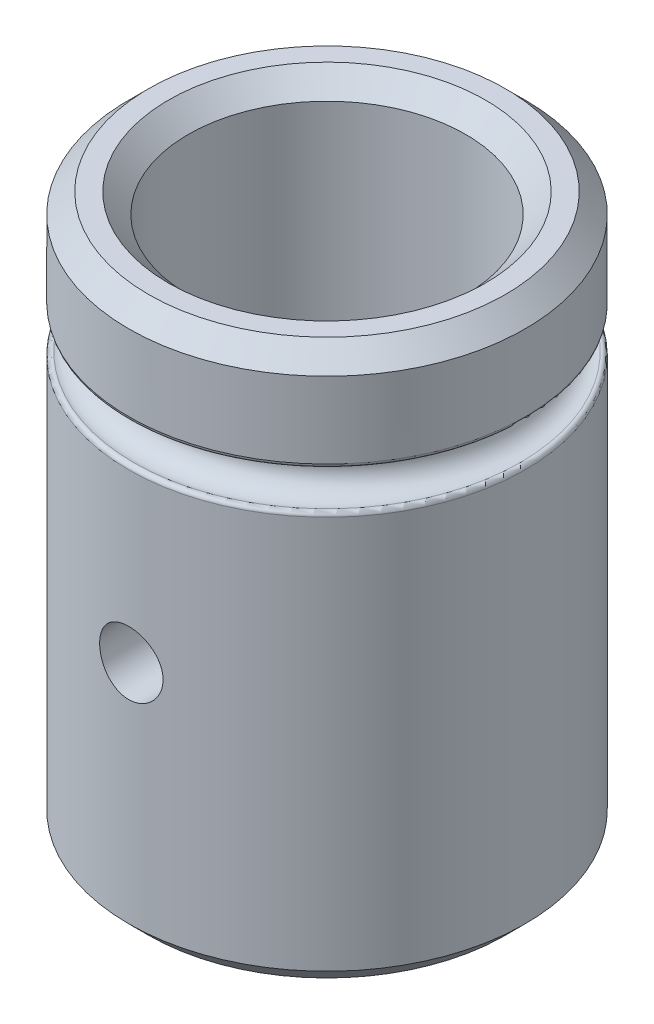
ISO-10303-21;
HEADER;
FILE_DESCRIPTION(('STEP AP214'),'2;1');
FILE_NAME('part.step','',(''),(''),'','','');
FILE_SCHEMA(('AUTOMOTIVE_DESIGN { 1 0 10303 214 1 1 1 1 }'));
ENDSEC;
DATA;
#1=APPLICATION_CONTEXT('core data for automotive mechanical design processes');
#2=APPLICATION_PROTOCOL_DEFINITION('international standard','automotive_design',2000,#1);
#3=PRODUCT_CONTEXT('',#1,'mechanical');
#4=PRODUCT('Part','Part','',(#3));
#5=PRODUCT_RELATED_PRODUCT_CATEGORY('part','',(#4));
#6=PRODUCT_DEFINITION_FORMATION('','',#4);
#7=PRODUCT_DEFINITION_CONTEXT('part definition',#1,'design');
#8=PRODUCT_DEFINITION('design','',#6,#7);
#9=PRODUCT_DEFINITION_SHAPE('','',#8);
#10=(LENGTH_UNIT() NAMED_UNIT(*) SI_UNIT(.MILLI.,.METRE.));
#11=(NAMED_UNIT(*) PLANE_ANGLE_UNIT() SI_UNIT($,.RADIAN.));
#12=(NAMED_UNIT(*) SI_UNIT($,.STERADIAN.) SOLID_ANGLE_UNIT());
#13=UNCERTAINTY_MEASURE_WITH_UNIT(LENGTH_MEASURE(1.E-05),#10,'distance_accuracy_value','');
#14=(GEOMETRIC_REPRESENTATION_CONTEXT(3) GLOBAL_UNCERTAINTY_ASSIGNED_CONTEXT((#13)) GLOBAL_UNIT_ASSIGNED_CONTEXT((#10,
#11,#12)) REPRESENTATION_CONTEXT('',''));
#15=CARTESIAN_POINT('',(0.,0.,0.));
#16=DIRECTION('',(0.,0.,1.));
#17=DIRECTION('',(1.,0.,0.));
#18=AXIS2_PLACEMENT_3D('',#15,#16,#17);
#19=CARTESIAN_POINT('',(0.,14.,0.));
#20=DIRECTION('',(0.,-1.,0.));
#21=DIRECTION('',(0.,0.,-1.));
#22=AXIS2_PLACEMENT_3D('',#19,#20,#21);
#23=CYLINDRICAL_SURFACE('',#22,5.);
#24=CARTESIAN_POINT('',(0.,0.499999999999999,0.));
#25=DIRECTION('',(0.,1.,0.));
#26=DIRECTION('',(0.,0.,1.));
#27=AXIS2_PLACEMENT_3D('',#24,#25,#26);
#28=CIRCLE('',#27,5.);
#29=CARTESIAN_POINT('',(0.,0.499999999999999,5.));
#30=VERTEX_POINT('',#29);
#31=EDGE_CURVE('E46',#30,#30,#28,.T.);
#32=ORIENTED_EDGE('',*,*,#31,.T.);
#33=EDGE_LOOP('',(#32));
#34=FACE_BOUND('',#33,.T.);
#35=CARTESIAN_POINT('',(0.,10.4190524980689,0.));
#36=DIRECTION('',(0.,1.,0.));
#37=DIRECTION('',(0.,0.,1.));
#38=AXIS2_PLACEMENT_3D('',#35,#36,#37);
#39=CIRCLE('',#38,5.);
#40=CARTESIAN_POINT('',(0.,10.4190524980689,5.));
#41=VERTEX_POINT('',#40);
#42=EDGE_CURVE('E71',#41,#41,#39,.F.);
#43=ORIENTED_EDGE('',*,*,#42,.T.);
#44=EDGE_LOOP('',(#43));
#45=FACE_BOUND('',#44,.T.);
#46=CARTESIAN_POINT('',(0.,5.4,5.));
#47=CARTESIAN_POINT('',(0.0446308080511735,5.40000181145207,4.99999925368398));
#48=CARTESIAN_POINT('',(0.0892866095441337,5.40374744291726,4.99939618705492));
#49=CARTESIAN_POINT('',(0.177347511863295,5.41862577907919,4.99704849367426));
#50=CARTESIAN_POINT('',(0.22075139445407,5.42976544156006,4.99530279172417));
#51=CARTESIAN_POINT('',(0.305021508450515,5.4590883521784,4.99086578560516));
#52=CARTESIAN_POINT('',(0.345889721177602,5.47726601844832,4.98817523095935));
#53=CARTESIAN_POINT('',(0.423990337738185,5.52013471775911,4.98214495920462));
#54=CARTESIAN_POINT('',(0.461223193179573,5.54482494035345,4.97880532288341));
#55=CARTESIAN_POINT('',(0.531330998418697,5.60025024170497,4.97181457161351));
#56=CARTESIAN_POINT('',(0.564169146610388,5.63103159157806,4.96816120177215));
#57=CARTESIAN_POINT('',(0.624237641135132,5.69766578690999,4.96097215963753));
#58=CARTESIAN_POINT('',(0.651467646762836,5.73351894026747,4.95743649450599));
#59=CARTESIAN_POINT('',(0.699692661652856,5.80952955446083,4.95086133431278));
#60=CARTESIAN_POINT('',(0.720651599384386,5.84971017494464,4.94782475339399));
#61=CARTESIAN_POINT('',(0.755508923850426,5.93307826514752,4.9426226637982));
#62=CARTESIAN_POINT('',(0.769407749272037,5.97626554785499,4.94045710100136));
#63=CARTESIAN_POINT('',(0.78963503472531,6.06403215074593,4.93726457896945));
#64=CARTESIAN_POINT('',(0.796026817801601,6.10859652438001,4.93622810120145));
#65=CARTESIAN_POINT('',(0.801254845350307,6.19817639483417,4.93538226863644));
#66=CARTESIAN_POINT('',(0.80009158277677,6.2431918620298,4.93557283377695));
#67=CARTESIAN_POINT('',(0.790294188232538,6.33194601219957,4.93715085922415));
#68=CARTESIAN_POINT('',(0.781730938905658,6.37569275094442,4.93852696316707));
#69=CARTESIAN_POINT('',(0.757487774055362,6.46112042843918,4.94230325280695));
#70=CARTESIAN_POINT('',(0.741807631982687,6.50280130138036,4.944703471104));
#71=CARTESIAN_POINT('',(0.703703154988826,6.58312770714234,4.9502699273064));
#72=CARTESIAN_POINT('',(0.681249143270038,6.62175891987415,4.95343952372276));
#73=CARTESIAN_POINT('',(0.630255410529452,6.69473210867413,4.96018523245969));
#74=CARTESIAN_POINT('',(0.601715236062147,6.72907376484927,4.96376137506045));
#75=CARTESIAN_POINT('',(0.538971936351568,6.79290352017494,4.97096724981016));
#76=CARTESIAN_POINT('',(0.504707942182397,6.82233180282752,4.97459712801084));
#77=CARTESIAN_POINT('',(0.431696149872209,6.8750298955372,4.98146370833866));
#78=CARTESIAN_POINT('',(0.392948326886552,6.89829967146803,4.98470040828701));
#79=CARTESIAN_POINT('',(0.312014355323648,6.93802467124559,4.99042002279776));
#80=CARTESIAN_POINT('',(0.269825706968613,6.95447488690755,4.99290238302826));
#81=CARTESIAN_POINT('',(0.183235933575908,6.9800397431704,4.9968291023744));
#82=CARTESIAN_POINT('',(0.138834979228292,6.98915494877483,4.99827354143846));
#83=CARTESIAN_POINT('',(0.0495968221607874,6.99971058800518,4.99995098582024));
#84=CARTESIAN_POINT('',(0.00476957346417463,7.00123318638306,5.00019695987027));
#85=CARTESIAN_POINT('',(-0.0844997486044577,6.99677904735629,4.99948519003732));
#86=CARTESIAN_POINT('',(-0.128941835541716,6.99080257515546,4.9985274887222));
#87=CARTESIAN_POINT('',(-0.215927519294204,6.9715882807243,4.99552400060935));
#88=CARTESIAN_POINT('',(-0.258480269760834,6.95839086987818,4.99348427121022));
#89=CARTESIAN_POINT('',(-0.340769196234399,6.92515221258798,4.98854458459104));
#90=CARTESIAN_POINT('',(-0.380505224396477,6.90511060722476,4.98564458225813));
#91=CARTESIAN_POINT('',(-0.456391460451549,6.85856240027867,4.9792740860737));
#92=CARTESIAN_POINT('',(-0.492509601238282,6.83200414559077,4.97579911023324));
#93=CARTESIAN_POINT('',(-0.559805662558114,6.77324793825499,4.96867838165483));
#94=CARTESIAN_POINT('',(-0.590983253761131,6.7410496099487,4.96503261755335));
#95=CARTESIAN_POINT('',(-0.647815466120003,6.67155984475842,4.95793961092294));
#96=CARTESIAN_POINT('',(-0.67341474965888,6.63422288848527,4.95449458581512));
#97=CARTESIAN_POINT('',(-0.717977956840479,6.55573048755187,4.94823364120698));
#98=CARTESIAN_POINT('',(-0.736942078495341,6.51457515688916,4.94541770293382));
#99=CARTESIAN_POINT('',(-0.767612633416616,6.42977321631271,4.94075016481912));
#100=CARTESIAN_POINT('',(-0.779347259610064,6.38613701816085,4.9388948235089));
#101=CARTESIAN_POINT('',(-0.795314874217838,6.29748097200319,4.93634892888289));
#102=CARTESIAN_POINT('',(-0.799548458993818,6.25246123428366,4.93565828296954));
#103=CARTESIAN_POINT('',(-0.800378186473577,6.16286820262535,4.93552375034277));
#104=CARTESIAN_POINT('',(-0.797061391285786,6.11829571218409,4.93606565128661));
#105=CARTESIAN_POINT('',(-0.783072071891901,6.03035147094911,4.93830411303284));
#106=CARTESIAN_POINT('',(-0.772399566311448,5.98697971711524,4.9400006709115));
#107=CARTESIAN_POINT('',(-0.744034087420253,5.90269785999341,4.94435206344804));
#108=CARTESIAN_POINT('',(-0.726348031080534,5.86178537694347,4.94700595372412));
#109=CARTESIAN_POINT('',(-0.684466309136975,5.78349421293077,4.95297399069632));
#110=CARTESIAN_POINT('',(-0.660270362498029,5.74611568462471,4.95628816589566));
#111=CARTESIAN_POINT('',(-0.605742654398706,5.67551256766538,4.96324867230805));
#112=CARTESIAN_POINT('',(-0.575346658323836,5.64233790083983,4.96689824087121));
#113=CARTESIAN_POINT('',(-0.509417337431811,5.58152984744099,4.97409200519902));
#114=CARTESIAN_POINT('',(-0.473882825608018,5.55389774474052,4.97763617638799));
#115=CARTESIAN_POINT('',(-0.398419338630933,5.50480101353127,4.98424562251661));
#116=CARTESIAN_POINT('',(-0.358464019917938,5.48337645044504,4.98730773061183));
#117=CARTESIAN_POINT('',(-0.275490066787462,5.44757548284037,4.99257715001872));
#118=CARTESIAN_POINT('',(-0.232474584483901,5.43319194275841,4.99478532624932));
#119=CARTESIAN_POINT('',(-0.157734207535215,5.41506170450581,4.99760702358556));
#120=CARTESIAN_POINT('',(-0.126465390999476,5.40942243888288,4.9984996711327));
#121=CARTESIAN_POINT('',(-0.063468592060681,5.40189097085455,4.99969642026856));
#122=CARTESIAN_POINT('',(-0.0317406166155308,5.39999871172833,5.00000053076634));
#123=CARTESIAN_POINT('',(0.,5.4,5.));
#124=B_SPLINE_CURVE_WITH_KNOTS('',3,(#46,#47,#48,#49,#50,#51,#52,#53,#54,#55,#56,#57,#58,#59,
#60,#61,#62,#63,#64,#65,#66,#67,#68,#69,#70,#71,#72,#73,#74,#75,#76,#77,#78,#79,#80,#81,#82,#83,
#84,#85,#86,#87,#88,#89,#90,#91,#92,#93,#94,#95,#96,#97,#98,#99,#100,#101,#102,#103,#104,#105,
#106,#107,#108,#109,#110,#111,#112,#113,#114,#115,#116,#117,#118,#119,#120,#121,#122,#123),
.UNSPECIFIED.,.T.,.F.,(4,2,2,2,2,2,2,2,2,2,2,2,2,2,2,2,2,2,2,2,2,2,2,2,2,2,2,2,2,2,2,2,2,2,2,2,
2,2,4),(0.,0.133776418649178,0.267678899727787,0.401475399062742,0.535255256116415,
0.670093338432936,0.804939610005122,0.940547238503781,1.07614643985655,1.2105934338786,
1.34503165554811,1.478196223562,1.61136503084877,1.74512594827327,1.87889683494994,
2.01419325334956,2.14949042145488,2.28488677454408,2.42027269728078,2.55419028860046,
2.68810314407254,2.82127412090819,2.95445208248903,3.08872183713538,3.22300053825308,
3.35855610834642,3.49410763273008,3.62912714304126,3.76413591830011,3.89759582738457,
4.03105539853193,4.16438367394704,4.29771770613194,4.43251052341619,4.56733452797894,
4.70301027460095,4.83854823761407,4.93368902667994,5.0288283755278),.UNSPECIFIED.);
#125=CARTESIAN_POINT('',(0.,5.4,5.));
#126=VERTEX_POINT('',#125);
#127=EDGE_CURVE('E83',#126,#126,#124,.T.);
#128=ORIENTED_EDGE('',*,*,#127,.F.);
#129=EDGE_LOOP('',(#128));
#130=FACE_BOUND('',#129,.T.);
#131=ADVANCED_FACE('F38',(#34,#45,#130),#23,.T.);
#132=CARTESIAN_POINT('',(0.,13.5,0.));
#133=DIRECTION('',(0.,1.,0.));
#134=DIRECTION('',(0.,0.,1.));
#135=AXIS2_PLACEMENT_3D('',#132,#133,#134);
#136=CIRCLE('',#135,5.);
#137=CARTESIAN_POINT('',(0.,13.5,5.));
#138=VERTEX_POINT('',#137);
#139=EDGE_CURVE('E10',#138,#138,#136,.F.);
#140=ORIENTED_EDGE('',*,*,#139,.T.);
#141=EDGE_LOOP('',(#140));
#142=FACE_BOUND('',#141,.T.);
#143=CARTESIAN_POINT('',(0.,11.5809475019311,0.));
#144=DIRECTION('',(0.,-1.,0.));
#145=DIRECTION('',(0.,0.,-1.));
#146=AXIS2_PLACEMENT_3D('',#143,#144,#145);
#147=CIRCLE('',#146,5.);
#148=CARTESIAN_POINT('',(0.,11.5809475019311,-5.));
#149=VERTEX_POINT('',#148);
#150=EDGE_CURVE('E80',#149,#149,#147,.F.);
#151=ORIENTED_EDGE('',*,*,#150,.T.);
#152=EDGE_LOOP('',(#151));
#153=FACE_BOUND('',#152,.T.);
#154=ADVANCED_FACE('F118',(#142,#153),#23,.T.);
#155=CARTESIAN_POINT('',(0.,14.,0.));
#156=DIRECTION('',(0.,-1.,0.));
#157=DIRECTION('',(0.,0.,-1.));
#158=AXIS2_PLACEMENT_3D('',#155,#156,#157);
#159=CYLINDRICAL_SURFACE('',#158,3.5);
#160=CARTESIAN_POINT('',(0.,13.5,0.));
#161=DIRECTION('',(0.,1.,0.));
#162=DIRECTION('',(0.,0.,1.));
#163=AXIS2_PLACEMENT_3D('',#160,#161,#162);
#164=CIRCLE('',#163,3.5);
#165=CARTESIAN_POINT('',(0.,13.5,3.5));
#166=VERTEX_POINT('',#165);
#167=EDGE_CURVE('E65',#166,#166,#164,.T.);
#168=ORIENTED_EDGE('',*,*,#167,.T.);
#169=EDGE_LOOP('',(#168));
#170=FACE_BOUND('',#169,.T.);
#171=CARTESIAN_POINT('',(0.,0.499999999999999,0.));
#172=DIRECTION('',(0.,1.,0.));
#173=DIRECTION('',(0.,0.,1.));
#174=AXIS2_PLACEMENT_3D('',#171,#172,#173);
#175=CIRCLE('',#174,3.5);
#176=CARTESIAN_POINT('',(0.,0.499999999999999,3.5));
#177=VERTEX_POINT('',#176);
#178=EDGE_CURVE('E68',#177,#177,#175,.F.);
#179=ORIENTED_EDGE('',*,*,#178,.T.);
#180=EDGE_LOOP('',(#179));
#181=FACE_BOUND('',#180,.T.);
#182=CARTESIAN_POINT('',(-0.8,6.2,3.40734500748016));
#183=CARTESIAN_POINT('',(-0.799998548685319,6.15569806278827,3.40734589874906));
#184=CARTESIAN_POINT('',(-0.796307486180493,6.11137912071936,3.40821844052343));
#185=CARTESIAN_POINT('',(-0.781659115602209,6.02400529635062,3.41160717457175));
#186=CARTESIAN_POINT('',(-0.770696865510746,5.9809512945929,3.41412448473028));
#187=CARTESIAN_POINT('',(-0.741872392364006,5.897383829198,3.42050310160737));
#188=CARTESIAN_POINT('',(-0.724018139879283,5.85686749344098,3.42436285528734));
#189=CARTESIAN_POINT('',(-0.681939769838266,5.77940326389329,3.43298957523517));
#190=CARTESIAN_POINT('',(-0.657715660394617,5.74245536555796,3.4377565403476));
#191=CARTESIAN_POINT('',(-0.603109051011644,5.67249561330843,3.44775877713435));
#192=CARTESIAN_POINT('',(-0.572631142830606,5.63955913850894,3.45300050066473));
#193=CARTESIAN_POINT('',(-0.506587925723071,5.57921852759099,3.46330531981387));
#194=CARTESIAN_POINT('',(-0.471022198722834,5.5518148465572,3.46836840071062));
#195=CARTESIAN_POINT('',(-0.395304174792665,5.50301643898656,3.47781607372608));
#196=CARTESIAN_POINT('',(-0.355103696524136,5.48169468518884,3.48219216421933));
#197=CARTESIAN_POINT('',(-0.271573223085822,5.44613819162377,3.48969969090158));
#198=CARTESIAN_POINT('',(-0.228243612818644,5.43190258191131,3.49283127986486));
#199=CARTESIAN_POINT('',(-0.140469295512524,5.4111608767719,3.49745136012806));
#200=CARTESIAN_POINT('',(-0.0960562198843013,5.40452706724275,3.49896696950012));
#201=CARTESIAN_POINT('',(-0.00672343123699823,5.39877748795801,3.50027844294199));
#202=CARTESIAN_POINT('',(0.0381962180192179,5.39966078233695,3.50007452109027));
#203=CARTESIAN_POINT('',(0.126385024866774,5.40882619984116,3.49799047180158));
#204=CARTESIAN_POINT('',(0.169669341740767,5.4169706073442,3.4961415451708));
#205=CARTESIAN_POINT('',(0.254240049459953,5.44020703474042,3.4910110099398));
#206=CARTESIAN_POINT('',(0.295526344605894,5.45529938705607,3.48772933279041));
#207=CARTESIAN_POINT('',(0.37530544934686,5.492121931288,3.4800525831758));
#208=CARTESIAN_POINT('',(0.413773756318213,5.51390335525551,3.47564896365191));
#209=CARTESIAN_POINT('',(0.486558887844343,5.56344736015075,3.46620965856556));
#210=CARTESIAN_POINT('',(0.520875097516698,5.59121082526781,3.4611738796113));
#211=CARTESIAN_POINT('',(0.585201794491186,5.65267720223364,3.45088764524487));
#212=CARTESIAN_POINT('',(0.615096886141809,5.68650061170448,3.44563491149941));
#213=CARTESIAN_POINT('',(0.668813461825874,5.75873542878397,3.43561310171268));
#214=CARTESIAN_POINT('',(0.692634749042317,5.79714698500881,3.43084404134749));
#215=CARTESIAN_POINT('',(0.733585446481735,5.87766615952666,3.4223228159587));
#216=CARTESIAN_POINT('',(0.750691268826712,5.91978618076638,3.41857424927168));
#217=CARTESIAN_POINT('',(0.777546063977044,6.00640937126505,3.41256699209136));
#218=CARTESIAN_POINT('',(0.787296323686847,6.05091212218981,3.41030804098864));
#219=CARTESIAN_POINT('',(0.798980512598404,6.13997831873729,3.40758942091692));
#220=CARTESIAN_POINT('',(0.801083246822812,6.1845184599759,3.40709090098174));
#221=CARTESIAN_POINT('',(0.797871265673863,6.27331290702344,3.40784449671928));
#222=CARTESIAN_POINT('',(0.792557110901282,6.31756723418147,3.40909648008136));
#223=CARTESIAN_POINT('',(0.774809149899664,6.40393444614773,3.41317316136639));
#224=CARTESIAN_POINT('',(0.762469899694555,6.44606784019467,3.41597695857317));
#225=CARTESIAN_POINT('',(0.731125126283363,6.52766894482042,3.42282219774622));
#226=CARTESIAN_POINT('',(0.712118917514245,6.56713638076095,3.42686376698711));
#227=CARTESIAN_POINT('',(0.667613485541496,6.64301115406964,3.43581344917209));
#228=CARTESIAN_POINT('',(0.642011196502949,6.67935643068473,3.4407348978927));
#229=CARTESIAN_POINT('',(0.585173832433159,6.74729682377422,3.45085540513723));
#230=CARTESIAN_POINT('',(0.553937990171622,6.77889129216281,3.45605450140583));
#231=CARTESIAN_POINT('',(0.485953003215151,6.83709700158014,3.46627365573566));
#232=CARTESIAN_POINT('',(0.449103847340522,6.86359263771805,3.47128784789964));
#233=CARTESIAN_POINT('',(0.371380011155932,6.91001801963161,3.48046058243587));
#234=CARTESIAN_POINT('',(0.330505527450705,6.9299480858759,3.48461916656705));
#235=CARTESIAN_POINT('',(0.246156809960182,6.96251988595682,3.49158758591833));
#236=CARTESIAN_POINT('',(0.202702048562905,6.97521004542156,3.4944063610291));
#237=CARTESIAN_POINT('',(0.114205166494747,6.99309152547518,3.49841637502363));
#238=CARTESIAN_POINT('',(0.0691633002363575,6.99828404238261,3.49960787355284));
#239=CARTESIAN_POINT('',(-0.0201353393459688,7.00096493449574,3.50022050083969));
#240=CARTESIAN_POINT('',(-0.0643867647373472,6.99862528018085,3.49968114835668));
#241=CARTESIAN_POINT('',(-0.151847921654547,6.98669568429438,3.49697823741169));
#242=CARTESIAN_POINT('',(-0.195057675340915,6.97710589710299,3.49481471353391));
#243=CARTESIAN_POINT('',(-0.2790616243462,6.95103379370496,3.48911046522945));
#244=CARTESIAN_POINT('',(-0.3198644073738,6.93457791620272,3.48557502713848));
#245=CARTESIAN_POINT('',(-0.398151595342827,6.89526578852863,3.47750281392671));
#246=CARTESIAN_POINT('',(-0.435635646566288,6.87240885719617,3.47296593224935));
#247=CARTESIAN_POINT('',(-0.507053369896725,6.82039361152248,3.46326777345013));
#248=CARTESIAN_POINT('',(-0.540898391900958,6.79111560358463,3.45809559296963));
#249=CARTESIAN_POINT('',(-0.603253598908188,6.72732805707455,3.44776541222813));
#250=CARTESIAN_POINT('',(-0.631762479118389,6.69281724270138,3.4426074157384));
#251=CARTESIAN_POINT('',(-0.683048084180978,6.61892484158204,3.43280336385053));
#252=CARTESIAN_POINT('',(-0.705733053971716,6.57947833233009,3.42816608318946));
#253=CARTESIAN_POINT('',(-0.744115460619786,6.49723378464833,3.42004092980586));
#254=CARTESIAN_POINT('',(-0.759818567032093,6.45443849889545,3.41655212507444));
#255=CARTESIAN_POINT('',(-0.781126076390095,6.37636058331663,3.41173446811944));
#256=CARTESIAN_POINT('',(-0.788189687642217,6.34148773355806,3.41009976987665));
#257=CARTESIAN_POINT('',(-0.797627095075605,6.27108021244636,3.40790471329556));
#258=CARTESIAN_POINT('',(-0.800001164459728,6.23554557976906,3.40734429237217));
#259=CARTESIAN_POINT('',(-0.8,6.2,3.40734500748016));
#260=B_SPLINE_CURVE_WITH_KNOTS('',3,(#182,#183,#184,#185,#186,#187,#188,#189,#190,#191,#192,
#193,#194,#195,#196,#197,#198,#199,#200,#201,#202,#203,#204,#205,#206,#207,#208,#209,#210,#211,
#212,#213,#214,#215,#216,#217,#218,#219,#220,#221,#222,#223,#224,#225,#226,#227,#228,#229,#230,
#231,#232,#233,#234,#235,#236,#237,#238,#239,#240,#241,#242,#243,#244,#245,#246,#247,#248,#249,
#250,#251,#252,#253,#254,#255,#256,#257,#258,#259),.UNSPECIFIED.,.T.,.F.,(4,2,2,2,2,2,2,2,2,2,2,
2,2,2,2,2,2,2,2,2,2,2,2,2,2,2,2,2,2,2,2,2,2,2,2,2,2,2,4),(0.,0.132775464799406,
0.265641265879259,0.398353866389647,0.531066297878216,0.665978141141133,0.800901076688183,
0.937380616846966,1.07384339767839,1.20797827848006,1.34209645998244,1.47372380024961,
1.60535743884472,1.73802553339412,1.87071325072432,2.00641236720474,2.14211588035283,
2.27829187247467,2.41444403417499,2.54757199874318,2.68068990146485,2.81205705308907,
2.9434377171532,3.07701093880622,3.210602365473,3.34693605758858,3.48326309420446,
3.61866725368593,3.75404980578692,3.88636348609491,4.01867434907021,4.15048036757403,
4.28230041739335,4.4168257487644,4.55138393140484,4.68794737218362,4.82439971448826,
4.93093807713006,5.03747023288762),.UNSPECIFIED.);
#261=CARTESIAN_POINT('',(-0.8,6.2,3.40734500748016));
#262=VERTEX_POINT('',#261);
#263=EDGE_CURVE('E84',#262,#262,#260,.T.);
#264=ORIENTED_EDGE('',*,*,#263,.T.);
#265=EDGE_LOOP('',(#264));
#266=FACE_BOUND('',#265,.T.);
#267=ADVANCED_FACE('F96',(#170,#181,#266),#159,.F.);
#268=CARTESIAN_POINT('',(0.,14.,0.));
#269=DIRECTION('',(0.,1.,0.));
#270=DIRECTION('',(0.,0.,1.));
#271=AXIS2_PLACEMENT_3D('',#268,#269,#270);
#272=PLANE('',#271);
#273=CARTESIAN_POINT('',(0.,14.,0.));
#274=DIRECTION('',(0.,1.,0.));
#275=DIRECTION('',(0.,0.,1.));
#276=AXIS2_PLACEMENT_3D('',#273,#274,#275);
#277=CIRCLE('',#276,4.);
#278=CARTESIAN_POINT('',(0.,14.,4.));
#279=VERTEX_POINT('',#278);
#280=EDGE_CURVE('E59',#279,#279,#277,.F.);
#281=ORIENTED_EDGE('',*,*,#280,.T.);
#282=EDGE_LOOP('',(#281));
#283=FACE_BOUND('',#282,.T.);
#284=CARTESIAN_POINT('',(0.,14.,0.));
#285=DIRECTION('',(0.,1.,0.));
#286=DIRECTION('',(0.,0.,1.));
#287=AXIS2_PLACEMENT_3D('',#284,#285,#286);
#288=CIRCLE('',#287,4.5);
#289=CARTESIAN_POINT('',(0.,14.,4.5));
#290=VERTEX_POINT('',#289);
#291=EDGE_CURVE('E62',#290,#290,#288,.T.);
#292=ORIENTED_EDGE('',*,*,#291,.T.);
#293=EDGE_LOOP('',(#292));
#294=FACE_BOUND('',#293,.T.);
#295=ADVANCED_FACE('F156',(#283,#294),#272,.T.);
#296=CARTESIAN_POINT('',(0.,0.,0.));
#297=DIRECTION('',(0.,1.,0.));
#298=DIRECTION('',(0.,0.,1.));
#299=AXIS2_PLACEMENT_3D('',#296,#297,#298);
#300=PLANE('',#299);
#301=CARTESIAN_POINT('',(0.,0.,0.));
#302=DIRECTION('',(0.,1.,0.));
#303=DIRECTION('',(0.,0.,1.));
#304=AXIS2_PLACEMENT_3D('',#301,#302,#303);
#305=CIRCLE('',#304,4.);
#306=CARTESIAN_POINT('',(0.,0.,4.));
#307=VERTEX_POINT('',#306);
#308=EDGE_CURVE('E50',#307,#307,#305,.T.);
#309=ORIENTED_EDGE('',*,*,#308,.T.);
#310=EDGE_LOOP('',(#309));
#311=FACE_BOUND('',#310,.T.);
#312=CARTESIAN_POINT('',(0.,0.,0.));
#313=DIRECTION('',(0.,1.,0.));
#314=DIRECTION('',(0.,0.,1.));
#315=AXIS2_PLACEMENT_3D('',#312,#313,#314);
#316=CIRCLE('',#315,4.5);
#317=CARTESIAN_POINT('',(0.,0.,4.5));
#318=VERTEX_POINT('',#317);
#319=EDGE_CURVE('E54',#318,#318,#316,.F.);
#320=ORIENTED_EDGE('',*,*,#319,.T.);
#321=EDGE_LOOP('',(#320));
#322=FACE_BOUND('',#321,.T.);
#323=ADVANCED_FACE('F104',(#311,#322),#300,.F.);
#324=CARTESIAN_POINT('',(0.,6.2,5.));
#325=DIRECTION('',(0.,0.,-1.));
#326=DIRECTION('',(-1.,0.,0.));
#327=AXIS2_PLACEMENT_3D('',#324,#325,#326);
#328=CYLINDRICAL_SURFACE('',#327,0.8);
#329=ORIENTED_EDGE('',*,*,#263,.F.);
#330=EDGE_LOOP('',(#329));
#331=FACE_BOUND('',#330,.T.);
#332=ORIENTED_EDGE('',*,*,#127,.T.);
#333=EDGE_LOOP('',(#332));
#334=FACE_BOUND('',#333,.T.);
#335=ADVANCED_FACE('F99',(#331,#334),#328,.F.);
#336=CARTESIAN_POINT('',(0.,11.,0.));
#337=DIRECTION('',(0.,-1.,0.));
#338=DIRECTION('',(0.,0.,-1.));
#339=AXIS2_PLACEMENT_3D('',#336,#337,#338);
#340=TOROIDAL_SURFACE('',#339,4.75,0.500000000000001);
#341=CARTESIAN_POINT('',(0.,11.4841229182759,0.));
#342=DIRECTION('',(0.,-1.,0.));
#343=DIRECTION('',(0.,0.,-1.));
#344=AXIS2_PLACEMENT_3D('',#341,#342,#343);
#345=CIRCLE('',#344,4.87499999999998);
#346=CARTESIAN_POINT('',(0.,11.4841229182759,-4.87499999999998));
#347=VERTEX_POINT('',#346);
#348=EDGE_CURVE('E74',#347,#347,#345,.T.);
#349=ORIENTED_EDGE('',*,*,#348,.T.);
#350=EDGE_LOOP('',(#349));
#351=FACE_BOUND('',#350,.T.);
#352=CARTESIAN_POINT('',(0.,10.5158770817241,0.));
#353=DIRECTION('',(0.,1.,0.));
#354=DIRECTION('',(0.,0.,1.));
#355=AXIS2_PLACEMENT_3D('',#352,#353,#354);
#356=CIRCLE('',#355,4.87499999999998);
#357=CARTESIAN_POINT('',(0.,10.5158770817241,4.87499999999998));
#358=VERTEX_POINT('',#357);
#359=EDGE_CURVE('E77',#358,#358,#356,.T.);
#360=ORIENTED_EDGE('',*,*,#359,.T.);
#361=EDGE_LOOP('',(#360));
#362=FACE_BOUND('',#361,.T.);
#363=ADVANCED_FACE('F103',(#351,#362),#340,.F.);
#364=CARTESIAN_POINT('',(0.,11.5809475019311,0.));
#365=DIRECTION('',(0.,-1.,0.));
#366=DIRECTION('',(0.,0.,-1.));
#367=AXIS2_PLACEMENT_3D('',#364,#365,#366);
#368=TOROIDAL_SURFACE('',#367,4.9,0.1);
#369=ORIENTED_EDGE('',*,*,#348,.F.);
#370=EDGE_LOOP('',(#369));
#371=FACE_BOUND('',#370,.T.);
#372=ORIENTED_EDGE('',*,*,#150,.F.);
#373=EDGE_LOOP('',(#372));
#374=FACE_BOUND('',#373,.T.);
#375=ADVANCED_FACE('F108',(#371,#374),#368,.T.);
#376=CARTESIAN_POINT('',(0.,10.4190524980689,0.));
#377=DIRECTION('',(0.,1.,0.));
#378=DIRECTION('',(0.,0.,1.));
#379=AXIS2_PLACEMENT_3D('',#376,#377,#378);
#380=TOROIDAL_SURFACE('',#379,4.9,0.1);
#381=ORIENTED_EDGE('',*,*,#359,.F.);
#382=EDGE_LOOP('',(#381));
#383=FACE_BOUND('',#382,.T.);
#384=ORIENTED_EDGE('',*,*,#42,.F.);
#385=EDGE_LOOP('',(#384));
#386=FACE_BOUND('',#385,.T.);
#387=ADVANCED_FACE('F113',(#383,#386),#380,.T.);
#388=CARTESIAN_POINT('',(0.,13.5,0.));
#389=DIRECTION('',(0.,1.,0.));
#390=DIRECTION('',(0.,0.,1.));
#391=AXIS2_PLACEMENT_3D('',#388,#389,#390);
#392=CONICAL_SURFACE('',#391,3.5,0.78539816339745);
#393=ORIENTED_EDGE('',*,*,#280,.F.);
#394=EDGE_LOOP('',(#393));
#395=FACE_BOUND('',#394,.T.);
#396=ORIENTED_EDGE('',*,*,#167,.F.);
#397=EDGE_LOOP('',(#396));
#398=FACE_BOUND('',#397,.T.);
#399=ADVANCED_FACE('F128',(#395,#398),#392,.F.);
#400=CARTESIAN_POINT('',(0.,0.,0.));
#401=DIRECTION('',(0.,-1.,0.));
#402=DIRECTION('',(0.,0.,-1.));
#403=AXIS2_PLACEMENT_3D('',#400,#401,#402);
#404=CONICAL_SURFACE('',#403,4.,0.785398163397446);
#405=ORIENTED_EDGE('',*,*,#178,.F.);
#406=EDGE_LOOP('',(#405));
#407=FACE_BOUND('',#406,.T.);
#408=ORIENTED_EDGE('',*,*,#308,.F.);
#409=EDGE_LOOP('',(#408));
#410=FACE_BOUND('',#409,.T.);
#411=ADVANCED_FACE('F136',(#407,#410),#404,.F.);
#412=CARTESIAN_POINT('',(0.,0.499999999999999,0.));
#413=DIRECTION('',(0.,1.,0.));
#414=DIRECTION('',(0.,0.,1.));
#415=AXIS2_PLACEMENT_3D('',#412,#413,#414);
#416=CONICAL_SURFACE('',#415,5.,0.785398163397449);
#417=ORIENTED_EDGE('',*,*,#319,.F.);
#418=EDGE_LOOP('',(#417));
#419=FACE_BOUND('',#418,.T.);
#420=ORIENTED_EDGE('',*,*,#31,.F.);
#421=EDGE_LOOP('',(#420));
#422=FACE_BOUND('',#421,.T.);
#423=ADVANCED_FACE('F142',(#419,#422),#416,.T.);
#424=CARTESIAN_POINT('',(0.,14.,0.));
#425=DIRECTION('',(0.,-1.,0.));
#426=DIRECTION('',(0.,0.,-1.));
#427=AXIS2_PLACEMENT_3D('',#424,#425,#426);
#428=CONICAL_SURFACE('',#427,4.5,0.785398163397447);
#429=ORIENTED_EDGE('',*,*,#139,.F.);
#430=EDGE_LOOP('',(#429));
#431=FACE_BOUND('',#430,.T.);
#432=ORIENTED_EDGE('',*,*,#291,.F.);
#433=EDGE_LOOP('',(#432));
#434=FACE_BOUND('',#433,.T.);
#435=ADVANCED_FACE('F41',(#431,#434),#428,.T.);
#436=CLOSED_SHELL('',(#131,#154,#267,#295,#323,#335,#363,#375,#387,#399,#411,#423,#435));
#437=MANIFOLD_SOLID_BREP('B2',#436);
#438=ADVANCED_BREP_SHAPE_REPRESENTATION('',(#18,#437),#14);
#439=SHAPE_DEFINITION_REPRESENTATION(#9,#438);
ENDSEC;
END-ISO-10303-21;
